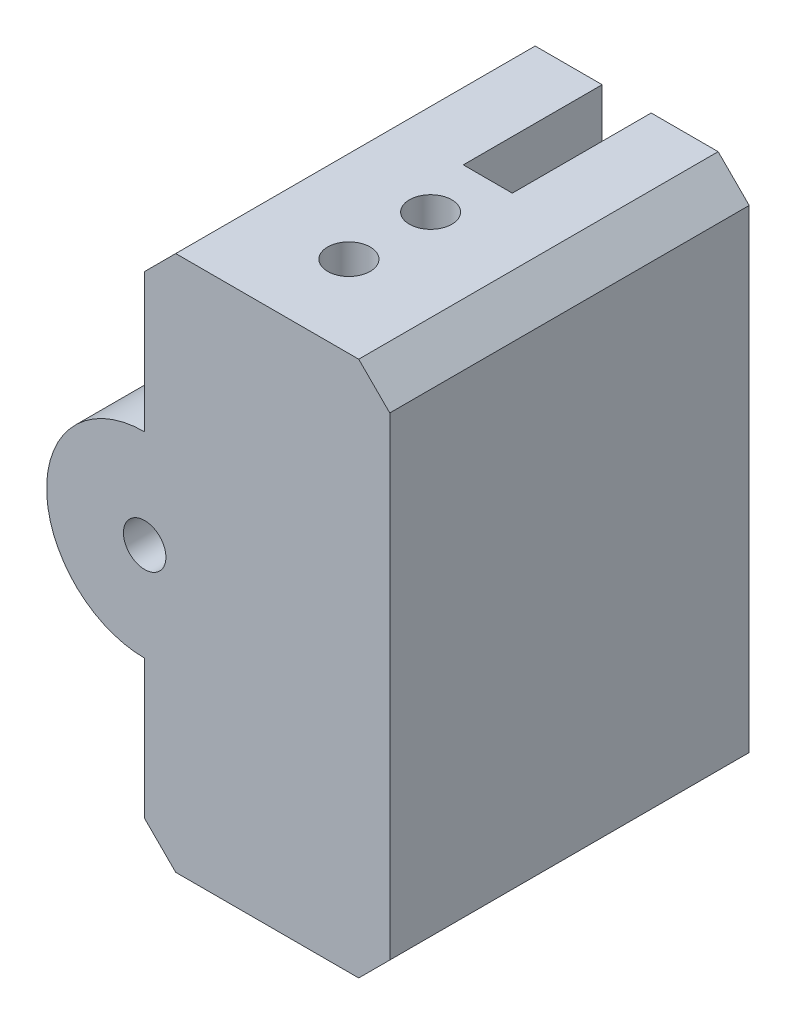
ISO-10303-21;
HEADER;
FILE_DESCRIPTION(('STEP AP214'),'2;1');
FILE_NAME('part.step','',(''),(''),'','','');
FILE_SCHEMA(('AUTOMOTIVE_DESIGN { 1 0 10303 214 1 1 1 1 }'));
ENDSEC;
DATA;
#1=APPLICATION_CONTEXT('core data for automotive mechanical design processes');
#2=APPLICATION_PROTOCOL_DEFINITION('international standard','automotive_design',2000,#1);
#3=PRODUCT_CONTEXT('',#1,'mechanical');
#4=PRODUCT('Part','Part','',(#3));
#5=PRODUCT_RELATED_PRODUCT_CATEGORY('part','',(#4));
#6=PRODUCT_DEFINITION_FORMATION('','',#4);
#7=PRODUCT_DEFINITION_CONTEXT('part definition',#1,'design');
#8=PRODUCT_DEFINITION('design','',#6,#7);
#9=PRODUCT_DEFINITION_SHAPE('','',#8);
#10=(LENGTH_UNIT() NAMED_UNIT(*) SI_UNIT(.MILLI.,.METRE.));
#11=(NAMED_UNIT(*) PLANE_ANGLE_UNIT() SI_UNIT($,.RADIAN.));
#12=(NAMED_UNIT(*) SI_UNIT($,.STERADIAN.) SOLID_ANGLE_UNIT());
#13=UNCERTAINTY_MEASURE_WITH_UNIT(LENGTH_MEASURE(1.E-05),#10,'distance_accuracy_value','');
#14=(GEOMETRIC_REPRESENTATION_CONTEXT(3) GLOBAL_UNCERTAINTY_ASSIGNED_CONTEXT((#13)) GLOBAL_UNIT_ASSIGNED_CONTEXT((#10,
#11,#12)) REPRESENTATION_CONTEXT('',''));
#15=CARTESIAN_POINT('',(0.,0.,0.));
#16=DIRECTION('',(0.,0.,1.));
#17=DIRECTION('',(1.,0.,0.));
#18=AXIS2_PLACEMENT_3D('',#15,#16,#17);
#19=CARTESIAN_POINT('',(-7.5,32.8,0.));
#20=DIRECTION('',(1.,0.,0.));
#21=DIRECTION('',(0.,0.,-1.));
#22=AXIS2_PLACEMENT_3D('',#19,#20,#21);
#23=PLANE('',#22);
#24=DIRECTION('',(0.,-1.,0.));
#25=VECTOR('',#24,1.);
#26=CARTESIAN_POINT('',(-7.5,32.8,22.));
#27=LINE('',#26,#25);
#28=CARTESIAN_POINT('',(-7.5,10.4,22.));
#29=VERTEX_POINT('',#28);
#30=CARTESIAN_POINT('',(-7.5,1.9,22.));
#31=VERTEX_POINT('',#30);
#32=EDGE_CURVE('E66',#29,#31,#27,.T.);
#33=ORIENTED_EDGE('',*,*,#32,.F.);
#34=DIRECTION('',(0.,0.,-1.));
#35=VECTOR('',#34,1.);
#36=CARTESIAN_POINT('',(-7.5,10.4,22.));
#37=LINE('',#36,#35);
#38=CARTESIAN_POINT('',(-7.5,10.4,0.));
#39=VERTEX_POINT('',#38);
#40=EDGE_CURVE('E154',#29,#39,#37,.T.);
#41=ORIENTED_EDGE('',*,*,#40,.T.);
#42=DIRECTION('',(0.,-1.,0.));
#43=VECTOR('',#42,1.);
#44=CARTESIAN_POINT('',(-7.5,32.8,0.));
#45=LINE('',#44,#43);
#46=CARTESIAN_POINT('',(-7.5,1.9,0.));
#47=VERTEX_POINT('',#46);
#48=EDGE_CURVE('E145',#39,#47,#45,.T.);
#49=ORIENTED_EDGE('',*,*,#48,.T.);
#50=DIRECTION('',(0.,0.,1.));
#51=VECTOR('',#50,1.);
#52=CARTESIAN_POINT('',(-7.5,1.9,0.));
#53=LINE('',#52,#51);
#54=EDGE_CURVE('E248',#47,#31,#53,.T.);
#55=ORIENTED_EDGE('',*,*,#54,.T.);
#56=EDGE_LOOP('',(#33,#41,#49,#55));
#57=FACE_BOUND('',#56,.T.);
#58=ADVANCED_FACE('F43',(#57),#23,.F.);
#59=CARTESIAN_POINT('',(1.5,32.8,0.));
#60=DIRECTION('',(-1.,0.,0.));
#61=DIRECTION('',(0.,0.,1.));
#62=AXIS2_PLACEMENT_3D('',#59,#60,#61);
#63=PLANE('',#62);
#64=DIRECTION('',(0.,0.,-1.));
#65=VECTOR('',#64,1.);
#66=CARTESIAN_POINT('',(1.5,0.,0.));
#67=LINE('',#66,#65);
#68=CARTESIAN_POINT('',(1.5,0.,8.5));
#69=VERTEX_POINT('',#68);
#70=CARTESIAN_POINT('',(1.5,0.,0.));
#71=VERTEX_POINT('',#70);
#72=EDGE_CURVE('E197',#69,#71,#67,.T.);
#73=ORIENTED_EDGE('',*,*,#72,.F.);
#74=DIRECTION('',(0.,-1.,0.));
#75=VECTOR('',#74,1.);
#76=CARTESIAN_POINT('',(1.5,32.8,8.5));
#77=LINE('',#76,#75);
#78=CARTESIAN_POINT('',(1.5,32.8,8.5));
#79=VERTEX_POINT('',#78);
#80=EDGE_CURVE('E225',#79,#69,#77,.T.);
#81=ORIENTED_EDGE('',*,*,#80,.F.);
#82=DIRECTION('',(0.,0.,-1.));
#83=VECTOR('',#82,1.);
#84=CARTESIAN_POINT('',(1.5,32.8,0.));
#85=LINE('',#84,#83);
#86=CARTESIAN_POINT('',(1.5,32.8,0.));
#87=VERTEX_POINT('',#86);
#88=EDGE_CURVE('E178',#79,#87,#85,.T.);
#89=ORIENTED_EDGE('',*,*,#88,.T.);
#90=DIRECTION('',(0.,-1.,0.));
#91=VECTOR('',#90,1.);
#92=CARTESIAN_POINT('',(1.5,32.8,0.));
#93=LINE('',#92,#91);
#94=EDGE_CURVE('E211',#87,#71,#93,.T.);
#95=ORIENTED_EDGE('',*,*,#94,.T.);
#96=EDGE_LOOP('',(#73,#81,#89,#95));
#97=FACE_BOUND('',#96,.T.);
#98=ADVANCED_FACE('F289',(#97),#63,.T.);
#99=CARTESIAN_POINT('',(0.,32.8,8.5));
#100=DIRECTION('',(0.,0.,-1.));
#101=DIRECTION('',(-1.,0.,0.));
#102=AXIS2_PLACEMENT_3D('',#99,#100,#101);
#103=PLANE('',#102);
#104=DIRECTION('',(1.,0.,0.));
#105=VECTOR('',#104,1.);
#106=CARTESIAN_POINT('',(0.,0.,8.5));
#107=LINE('',#106,#105);
#108=CARTESIAN_POINT('',(-1.5,0.,8.5));
#109=VERTEX_POINT('',#108);
#110=EDGE_CURVE('E200',#109,#69,#107,.T.);
#111=ORIENTED_EDGE('',*,*,#110,.F.);
#112=DIRECTION('',(0.,-1.,0.));
#113=VECTOR('',#112,1.);
#114=CARTESIAN_POINT('',(-1.5,32.8,8.5));
#115=LINE('',#114,#113);
#116=CARTESIAN_POINT('',(-1.5,32.8,8.5));
#117=VERTEX_POINT('',#116);
#118=EDGE_CURVE('E223',#117,#109,#115,.T.);
#119=ORIENTED_EDGE('',*,*,#118,.F.);
#120=DIRECTION('',(1.,0.,0.));
#121=VECTOR('',#120,1.);
#122=CARTESIAN_POINT('',(0.,32.8,8.5));
#123=LINE('',#122,#121);
#124=EDGE_CURVE('E181',#117,#79,#123,.T.);
#125=ORIENTED_EDGE('',*,*,#124,.T.);
#126=ORIENTED_EDGE('',*,*,#80,.T.);
#127=EDGE_LOOP('',(#111,#119,#125,#126));
#128=FACE_BOUND('',#127,.T.);
#129=ADVANCED_FACE('F293',(#128),#103,.T.);
#130=CARTESIAN_POINT('',(-1.5,32.8,0.));
#131=DIRECTION('',(-1.,0.,0.));
#132=DIRECTION('',(0.,0.,1.));
#133=AXIS2_PLACEMENT_3D('',#130,#131,#132);
#134=PLANE('',#133);
#135=ORIENTED_EDGE('',*,*,#118,.T.);
#136=DIRECTION('',(0.,0.,-1.));
#137=VECTOR('',#136,1.);
#138=CARTESIAN_POINT('',(-1.5,0.,0.));
#139=LINE('',#138,#137);
#140=CARTESIAN_POINT('',(-1.5,0.,0.));
#141=VERTEX_POINT('',#140);
#142=EDGE_CURVE('E203',#109,#141,#139,.T.);
#143=ORIENTED_EDGE('',*,*,#142,.T.);
#144=DIRECTION('',(0.,-1.,0.));
#145=VECTOR('',#144,1.);
#146=CARTESIAN_POINT('',(-1.5,32.8,0.));
#147=LINE('',#146,#145);
#148=CARTESIAN_POINT('',(-1.5,32.8,0.));
#149=VERTEX_POINT('',#148);
#150=EDGE_CURVE('E221',#149,#141,#147,.T.);
#151=ORIENTED_EDGE('',*,*,#150,.F.);
#152=DIRECTION('',(0.,0.,-1.));
#153=VECTOR('',#152,1.);
#154=CARTESIAN_POINT('',(-1.5,32.8,0.));
#155=LINE('',#154,#153);
#156=EDGE_CURVE('E184',#117,#149,#155,.T.);
#157=ORIENTED_EDGE('',*,*,#156,.F.);
#158=EDGE_LOOP('',(#135,#143,#151,#157));
#159=FACE_BOUND('',#158,.T.);
#160=ADVANCED_FACE('F283',(#159),#134,.F.);
#161=CARTESIAN_POINT('',(0.,32.8,0.));
#162=DIRECTION('',(0.,0.,-1.));
#163=DIRECTION('',(-1.,0.,0.));
#164=AXIS2_PLACEMENT_3D('',#161,#162,#163);
#165=PLANE('',#164);
#166=CARTESIAN_POINT('',(-7.5,16.4,0.));
#167=DIRECTION('',(0.,0.,-1.));
#168=DIRECTION('',(-1.,0.,0.));
#169=AXIS2_PLACEMENT_3D('',#166,#167,#168);
#170=CIRCLE('',#169,1.3);
#171=CARTESIAN_POINT('',(-8.8,16.4,0.));
#172=VERTEX_POINT('',#171);
#173=EDGE_CURVE('E163',#172,#172,#170,.T.);
#174=ORIENTED_EDGE('',*,*,#173,.F.);
#175=EDGE_LOOP('',(#174));
#176=FACE_BOUND('',#175,.T.);
#177=ORIENTED_EDGE('',*,*,#48,.F.);
#178=CARTESIAN_POINT('',(-7.5,16.4,0.));
#179=DIRECTION('',(0.,0.,-1.));
#180=DIRECTION('',(-1.,0.,0.));
#181=AXIS2_PLACEMENT_3D('',#178,#179,#180);
#182=CIRCLE('',#181,6.);
#183=CARTESIAN_POINT('',(-7.5,22.4,0.));
#184=VERTEX_POINT('',#183);
#185=EDGE_CURVE('E148',#39,#184,#182,.T.);
#186=ORIENTED_EDGE('',*,*,#185,.T.);
#187=CARTESIAN_POINT('',(-7.5,30.9,0.));
#188=VERTEX_POINT('',#187);
#189=EDGE_CURVE('E58',#188,#184,#45,.T.);
#190=ORIENTED_EDGE('',*,*,#189,.F.);
#191=DIRECTION('',(0.707106781186546,0.707106781186549,0.));
#192=VECTOR('',#191,1.);
#193=CARTESIAN_POINT('',(-2.80000000000001,35.6,0.));
#194=LINE('',#193,#192);
#195=CARTESIAN_POINT('',(-5.6,32.8,0.));
#196=VERTEX_POINT('',#195);
#197=EDGE_CURVE('E256',#188,#196,#194,.T.);
#198=ORIENTED_EDGE('',*,*,#197,.T.);
#199=DIRECTION('',(1.,0.,0.));
#200=VECTOR('',#199,1.);
#201=CARTESIAN_POINT('',(0.,32.8,0.));
#202=LINE('',#201,#200);
#203=EDGE_CURVE('E187',#196,#149,#202,.T.);
#204=ORIENTED_EDGE('',*,*,#203,.T.);
#205=ORIENTED_EDGE('',*,*,#150,.T.);
#206=DIRECTION('',(1.,0.,0.));
#207=VECTOR('',#206,1.);
#208=CARTESIAN_POINT('',(0.,0.,0.));
#209=LINE('',#208,#207);
#210=CARTESIAN_POINT('',(-5.59999999999999,0.,0.));
#211=VERTEX_POINT('',#210);
#212=EDGE_CURVE('E206',#211,#141,#209,.T.);
#213=ORIENTED_EDGE('',*,*,#212,.F.);
#214=DIRECTION('',(0.70710678118655,-0.707106781186546,0.));
#215=VECTOR('',#214,1.);
#216=CARTESIAN_POINT('',(-19.2,13.5999999999999,0.));
#217=LINE('',#216,#215);
#218=EDGE_CURVE('E51',#211,#47,#217,.F.);
#219=ORIENTED_EDGE('',*,*,#218,.T.);
#220=EDGE_LOOP('',(#177,#186,#190,#198,#204,#205,#213,#219));
#221=FACE_BOUND('',#220,.T.);
#222=ADVANCED_FACE('F146',(#176,#221),#165,.T.);
#223=ORIENTED_EDGE('',*,*,#189,.T.);
#224=DIRECTION('',(0.,0.,-1.));
#225=VECTOR('',#224,1.);
#226=CARTESIAN_POINT('',(-7.5,22.4,22.));
#227=LINE('',#226,#225);
#228=CARTESIAN_POINT('',(-7.5,22.4,22.));
#229=VERTEX_POINT('',#228);
#230=EDGE_CURVE('E159',#184,#229,#227,.F.);
#231=ORIENTED_EDGE('',*,*,#230,.T.);
#232=CARTESIAN_POINT('',(-7.5,30.9,22.));
#233=VERTEX_POINT('',#232);
#234=EDGE_CURVE('E152',#233,#229,#27,.T.);
#235=ORIENTED_EDGE('',*,*,#234,.F.);
#236=DIRECTION('',(0.,0.,-1.));
#237=VECTOR('',#236,1.);
#238=CARTESIAN_POINT('',(-7.5,30.9,0.));
#239=LINE('',#238,#237);
#240=EDGE_CURVE('E246',#233,#188,#239,.T.);
#241=ORIENTED_EDGE('',*,*,#240,.T.);
#242=EDGE_LOOP('',(#223,#231,#235,#241));
#243=FACE_BOUND('',#242,.T.);
#244=ADVANCED_FACE('F271',(#243),#23,.F.);
#245=CARTESIAN_POINT('',(0.,32.8,22.));
#246=DIRECTION('',(0.,0.,-1.));
#247=DIRECTION('',(-1.,0.,0.));
#248=AXIS2_PLACEMENT_3D('',#245,#246,#247);
#249=PLANE('',#248);
#250=CARTESIAN_POINT('',(-7.5,16.4,22.));
#251=DIRECTION('',(0.,0.,-1.));
#252=DIRECTION('',(-1.,0.,0.));
#253=AXIS2_PLACEMENT_3D('',#250,#251,#252);
#254=CIRCLE('',#253,1.3);
#255=CARTESIAN_POINT('',(-8.8,16.4,22.));
#256=VERTEX_POINT('',#255);
#257=EDGE_CURVE('E167',#256,#256,#254,.T.);
#258=ORIENTED_EDGE('',*,*,#257,.T.);
#259=EDGE_LOOP('',(#258));
#260=FACE_BOUND('',#259,.T.);
#261=ORIENTED_EDGE('',*,*,#234,.T.);
#262=CARTESIAN_POINT('',(-7.5,16.4,22.));
#263=DIRECTION('',(0.,0.,-1.));
#264=DIRECTION('',(-1.,0.,0.));
#265=AXIS2_PLACEMENT_3D('',#262,#263,#264);
#266=CIRCLE('',#265,6.);
#267=EDGE_CURVE('E162',#29,#229,#266,.T.);
#268=ORIENTED_EDGE('',*,*,#267,.F.);
#269=ORIENTED_EDGE('',*,*,#32,.T.);
#270=DIRECTION('',(-0.70710678118655,0.707106781186546,0.));
#271=VECTOR('',#270,1.);
#272=CARTESIAN_POINT('',(-7.5,1.9,22.));
#273=LINE('',#272,#271);
#274=CARTESIAN_POINT('',(-5.59999999999999,0.,22.));
#275=VERTEX_POINT('',#274);
#276=EDGE_CURVE('E252',#31,#275,#273,.F.);
#277=ORIENTED_EDGE('',*,*,#276,.T.);
#278=DIRECTION('',(1.,0.,0.));
#279=VECTOR('',#278,1.);
#280=CARTESIAN_POINT('',(0.,0.,22.));
#281=LINE('',#280,#279);
#282=CARTESIAN_POINT('',(5.6,0.,22.));
#283=VERTEX_POINT('',#282);
#284=EDGE_CURVE('E209',#275,#283,#281,.T.);
#285=ORIENTED_EDGE('',*,*,#284,.T.);
#286=DIRECTION('',(0.707106781186546,0.707106781186549,0.));
#287=VECTOR('',#286,1.);
#288=CARTESIAN_POINT('',(5.6,0.,22.));
#289=LINE('',#288,#287);
#290=CARTESIAN_POINT('',(7.50000000000001,1.90000000000001,22.));
#291=VERTEX_POINT('',#290);
#292=EDGE_CURVE('E232',#283,#291,#289,.T.);
#293=ORIENTED_EDGE('',*,*,#292,.T.);
#294=DIRECTION('',(0.,-1.,0.));
#295=VECTOR('',#294,1.);
#296=CARTESIAN_POINT('',(7.50000000000001,32.8,22.));
#297=LINE('',#296,#295);
#298=CARTESIAN_POINT('',(7.50000000000001,30.9,22.));
#299=VERTEX_POINT('',#298);
#300=EDGE_CURVE('E216',#299,#291,#297,.T.);
#301=ORIENTED_EDGE('',*,*,#300,.F.);
#302=DIRECTION('',(0.707106781186548,-0.707106781186547,0.));
#303=VECTOR('',#302,1.);
#304=CARTESIAN_POINT('',(7.50000000000001,30.9,22.));
#305=LINE('',#304,#303);
#306=CARTESIAN_POINT('',(5.60000000000001,32.8,22.));
#307=VERTEX_POINT('',#306);
#308=EDGE_CURVE('E234',#299,#307,#305,.F.);
#309=ORIENTED_EDGE('',*,*,#308,.T.);
#310=DIRECTION('',(1.,0.,0.));
#311=VECTOR('',#310,1.);
#312=CARTESIAN_POINT('',(0.,32.8,22.));
#313=LINE('',#312,#311);
#314=CARTESIAN_POINT('',(-5.6,32.8,22.));
#315=VERTEX_POINT('',#314);
#316=EDGE_CURVE('E189',#315,#307,#313,.T.);
#317=ORIENTED_EDGE('',*,*,#316,.F.);
#318=DIRECTION('',(-0.707106781186546,-0.707106781186549,0.));
#319=VECTOR('',#318,1.);
#320=CARTESIAN_POINT('',(-5.6,32.8,22.));
#321=LINE('',#320,#319);
#322=EDGE_CURVE('E250',#315,#233,#321,.T.);
#323=ORIENTED_EDGE('',*,*,#322,.T.);
#324=EDGE_LOOP('',(#261,#268,#269,#277,#285,#293,#301,#309,#317,#323));
#325=FACE_BOUND('',#324,.T.);
#326=ADVANCED_FACE('F270',(#260,#325),#249,.F.);
#327=CARTESIAN_POINT('',(7.5,32.8,0.));
#328=DIRECTION('',(1.,0.,0.));
#329=DIRECTION('',(0.,0.,-1.));
#330=AXIS2_PLACEMENT_3D('',#327,#328,#329);
#331=PLANE('',#330);
#332=DIRECTION('',(0.,-1.,0.));
#333=VECTOR('',#332,1.);
#334=CARTESIAN_POINT('',(7.5,32.8,0.));
#335=LINE('',#334,#333);
#336=CARTESIAN_POINT('',(7.5,30.9,0.));
#337=VERTEX_POINT('',#336);
#338=CARTESIAN_POINT('',(7.5,1.90000000000001,0.));
#339=VERTEX_POINT('',#338);
#340=EDGE_CURVE('E213',#337,#339,#335,.T.);
#341=ORIENTED_EDGE('',*,*,#340,.F.);
#342=DIRECTION('',(0.,0.,1.));
#343=VECTOR('',#342,1.);
#344=CARTESIAN_POINT('',(7.5,30.9,0.));
#345=LINE('',#344,#343);
#346=EDGE_CURVE('E229',#337,#299,#345,.T.);
#347=ORIENTED_EDGE('',*,*,#346,.T.);
#348=ORIENTED_EDGE('',*,*,#300,.T.);
#349=DIRECTION('',(0.,0.,-1.));
#350=VECTOR('',#349,1.);
#351=CARTESIAN_POINT('',(7.5,1.90000000000001,0.));
#352=LINE('',#351,#350);
#353=EDGE_CURVE('E227',#291,#339,#352,.T.);
#354=ORIENTED_EDGE('',*,*,#353,.T.);
#355=EDGE_LOOP('',(#341,#347,#348,#354));
#356=FACE_BOUND('',#355,.T.);
#357=ADVANCED_FACE('F279',(#356),#331,.T.);
#358=CARTESIAN_POINT('',(0.,32.8,17.));
#359=DIRECTION('',(0.,-1.,0.));
#360=DIRECTION('',(0.,0.,-1.));
#361=AXIS2_PLACEMENT_3D('',#358,#359,#360);
#362=CYLINDRICAL_SURFACE('',#361,1.3);
#363=CARTESIAN_POINT('',(0.,32.8,17.));
#364=DIRECTION('',(0.,1.,0.));
#365=DIRECTION('',(0.,0.,1.));
#366=AXIS2_PLACEMENT_3D('',#363,#364,#365);
#367=CIRCLE('',#366,1.3);
#368=CARTESIAN_POINT('',(0.,32.8,18.3));
#369=VERTEX_POINT('',#368);
#370=EDGE_CURVE('E174',#369,#369,#367,.T.);
#371=ORIENTED_EDGE('',*,*,#370,.T.);
#372=EDGE_LOOP('',(#371));
#373=FACE_BOUND('',#372,.T.);
#374=CARTESIAN_POINT('',(0.,0.,17.));
#375=DIRECTION('',(0.,1.,0.));
#376=DIRECTION('',(0.,0.,1.));
#377=AXIS2_PLACEMENT_3D('',#374,#375,#376);
#378=CIRCLE('',#377,1.3);
#379=CARTESIAN_POINT('',(0.,0.,18.3));
#380=VERTEX_POINT('',#379);
#381=EDGE_CURVE('E194',#380,#380,#378,.T.);
#382=ORIENTED_EDGE('',*,*,#381,.F.);
#383=EDGE_LOOP('',(#382));
#384=FACE_BOUND('',#383,.T.);
#385=ADVANCED_FACE('F304',(#373,#384),#362,.F.);
#386=CARTESIAN_POINT('',(0.,32.8,12.));
#387=DIRECTION('',(0.,-1.,0.));
#388=DIRECTION('',(0.,0.,-1.));
#389=AXIS2_PLACEMENT_3D('',#386,#387,#388);
#390=CYLINDRICAL_SURFACE('',#389,1.3);
#391=CARTESIAN_POINT('',(0.,32.8,12.));
#392=DIRECTION('',(0.,1.,0.));
#393=DIRECTION('',(0.,0.,1.));
#394=AXIS2_PLACEMENT_3D('',#391,#392,#393);
#395=CIRCLE('',#394,1.3);
#396=CARTESIAN_POINT('',(0.,32.8,13.3));
#397=VERTEX_POINT('',#396);
#398=EDGE_CURVE('E171',#397,#397,#395,.T.);
#399=ORIENTED_EDGE('',*,*,#398,.T.);
#400=EDGE_LOOP('',(#399));
#401=FACE_BOUND('',#400,.T.);
#402=CARTESIAN_POINT('',(0.,0.,12.));
#403=DIRECTION('',(0.,1.,0.));
#404=DIRECTION('',(0.,0.,1.));
#405=AXIS2_PLACEMENT_3D('',#402,#403,#404);
#406=CIRCLE('',#405,1.3);
#407=CARTESIAN_POINT('',(0.,0.,13.3));
#408=VERTEX_POINT('',#407);
#409=EDGE_CURVE('E158',#408,#408,#406,.T.);
#410=ORIENTED_EDGE('',*,*,#409,.F.);
#411=EDGE_LOOP('',(#410));
#412=FACE_BOUND('',#411,.T.);
#413=ADVANCED_FACE('F306',(#401,#412),#390,.F.);
#414=CARTESIAN_POINT('',(5.60000000000001,32.8,0.));
#415=VERTEX_POINT('',#414);
#416=EDGE_CURVE('E190',#87,#415,#202,.T.);
#417=ORIENTED_EDGE('',*,*,#416,.T.);
#418=DIRECTION('',(-0.707106781186548,0.707106781186547,0.));
#419=VECTOR('',#418,1.);
#420=CARTESIAN_POINT('',(2.8,35.6,0.));
#421=LINE('',#420,#419);
#422=EDGE_CURVE('E241',#415,#337,#421,.F.);
#423=ORIENTED_EDGE('',*,*,#422,.T.);
#424=ORIENTED_EDGE('',*,*,#340,.T.);
#425=DIRECTION('',(-0.707106781186546,-0.707106781186549,0.));
#426=VECTOR('',#425,1.);
#427=CARTESIAN_POINT('',(19.2,13.6000000000001,0.));
#428=LINE('',#427,#426);
#429=CARTESIAN_POINT('',(5.6,0.,0.));
#430=VERTEX_POINT('',#429);
#431=EDGE_CURVE('E239',#339,#430,#428,.T.);
#432=ORIENTED_EDGE('',*,*,#431,.T.);
#433=EDGE_CURVE('E175',#71,#430,#209,.T.);
#434=ORIENTED_EDGE('',*,*,#433,.F.);
#435=ORIENTED_EDGE('',*,*,#94,.F.);
#436=EDGE_LOOP('',(#417,#423,#424,#432,#434,#435));
#437=FACE_BOUND('',#436,.T.);
#438=ADVANCED_FACE('F286',(#437),#165,.T.);
#439=CARTESIAN_POINT('',(0.,32.8,0.));
#440=DIRECTION('',(0.,1.,0.));
#441=DIRECTION('',(0.,0.,1.));
#442=AXIS2_PLACEMENT_3D('',#439,#440,#441);
#443=PLANE('',#442);
#444=ORIENTED_EDGE('',*,*,#398,.F.);
#445=EDGE_LOOP('',(#444));
#446=FACE_BOUND('',#445,.T.);
#447=ORIENTED_EDGE('',*,*,#370,.F.);
#448=EDGE_LOOP('',(#447));
#449=FACE_BOUND('',#448,.T.);
#450=ORIENTED_EDGE('',*,*,#203,.F.);
#451=DIRECTION('',(0.,0.,1.));
#452=VECTOR('',#451,1.);
#453=CARTESIAN_POINT('',(-5.6,32.8,22.));
#454=LINE('',#453,#452);
#455=EDGE_CURVE('E11',#196,#315,#454,.T.);
#456=ORIENTED_EDGE('',*,*,#455,.T.);
#457=ORIENTED_EDGE('',*,*,#316,.T.);
#458=DIRECTION('',(0.,0.,-1.));
#459=VECTOR('',#458,1.);
#460=CARTESIAN_POINT('',(5.60000000000001,32.8,0.));
#461=LINE('',#460,#459);
#462=EDGE_CURVE('E237',#307,#415,#461,.T.);
#463=ORIENTED_EDGE('',*,*,#462,.T.);
#464=ORIENTED_EDGE('',*,*,#416,.F.);
#465=ORIENTED_EDGE('',*,*,#88,.F.);
#466=ORIENTED_EDGE('',*,*,#124,.F.);
#467=ORIENTED_EDGE('',*,*,#156,.T.);
#468=EDGE_LOOP('',(#450,#456,#457,#463,#464,#465,#466,#467));
#469=FACE_BOUND('',#468,.T.);
#470=ADVANCED_FACE('F263',(#446,#449,#469),#443,.T.);
#471=CARTESIAN_POINT('',(0.,0.,0.));
#472=DIRECTION('',(0.,1.,0.));
#473=DIRECTION('',(0.,0.,1.));
#474=AXIS2_PLACEMENT_3D('',#471,#472,#473);
#475=PLANE('',#474);
#476=ORIENTED_EDGE('',*,*,#409,.T.);
#477=EDGE_LOOP('',(#476));
#478=FACE_BOUND('',#477,.T.);
#479=ORIENTED_EDGE('',*,*,#381,.T.);
#480=EDGE_LOOP('',(#479));
#481=FACE_BOUND('',#480,.T.);
#482=ORIENTED_EDGE('',*,*,#284,.F.);
#483=DIRECTION('',(0.,0.,-1.));
#484=VECTOR('',#483,1.);
#485=CARTESIAN_POINT('',(-5.59999999999999,0.,0.));
#486=LINE('',#485,#484);
#487=EDGE_CURVE('E254',#275,#211,#486,.T.);
#488=ORIENTED_EDGE('',*,*,#487,.T.);
#489=ORIENTED_EDGE('',*,*,#212,.T.);
#490=ORIENTED_EDGE('',*,*,#142,.F.);
#491=ORIENTED_EDGE('',*,*,#110,.T.);
#492=ORIENTED_EDGE('',*,*,#72,.T.);
#493=ORIENTED_EDGE('',*,*,#433,.T.);
#494=DIRECTION('',(0.,0.,1.));
#495=VECTOR('',#494,1.);
#496=CARTESIAN_POINT('',(5.6,0.,22.));
#497=LINE('',#496,#495);
#498=EDGE_CURVE('E243',#430,#283,#497,.T.);
#499=ORIENTED_EDGE('',*,*,#498,.T.);
#500=EDGE_LOOP('',(#482,#488,#489,#490,#491,#492,#493,#499));
#501=FACE_BOUND('',#500,.T.);
#502=ADVANCED_FACE('F315',(#478,#481,#501),#475,.F.);
#503=CARTESIAN_POINT('',(7.5,30.9,0.));
#504=DIRECTION('',(-0.707106781186547,-0.707106781186548,0.));
#505=DIRECTION('',(0.,0.,1.));
#506=AXIS2_PLACEMENT_3D('',#503,#504,#505);
#507=PLANE('',#506);
#508=ORIENTED_EDGE('',*,*,#422,.F.);
#509=ORIENTED_EDGE('',*,*,#462,.F.);
#510=ORIENTED_EDGE('',*,*,#308,.F.);
#511=ORIENTED_EDGE('',*,*,#346,.F.);
#512=EDGE_LOOP('',(#508,#509,#510,#511));
#513=FACE_BOUND('',#512,.T.);
#514=ADVANCED_FACE('F311',(#513),#507,.F.);
#515=CARTESIAN_POINT('',(5.6,0.,0.));
#516=DIRECTION('',(0.707106781186549,-0.707106781186546,0.));
#517=DIRECTION('',(0.,0.,-1.));
#518=AXIS2_PLACEMENT_3D('',#515,#516,#517);
#519=PLANE('',#518);
#520=ORIENTED_EDGE('',*,*,#431,.F.);
#521=ORIENTED_EDGE('',*,*,#353,.F.);
#522=ORIENTED_EDGE('',*,*,#292,.F.);
#523=ORIENTED_EDGE('',*,*,#498,.F.);
#524=EDGE_LOOP('',(#520,#521,#522,#523));
#525=FACE_BOUND('',#524,.T.);
#526=ADVANCED_FACE('F314',(#525),#519,.T.);
#527=CARTESIAN_POINT('',(-7.5,1.9,0.));
#528=DIRECTION('',(0.707106781186546,0.70710678118655,0.));
#529=DIRECTION('',(0.,0.,1.));
#530=AXIS2_PLACEMENT_3D('',#527,#528,#529);
#531=PLANE('',#530);
#532=ORIENTED_EDGE('',*,*,#218,.F.);
#533=ORIENTED_EDGE('',*,*,#487,.F.);
#534=ORIENTED_EDGE('',*,*,#276,.F.);
#535=ORIENTED_EDGE('',*,*,#54,.F.);
#536=EDGE_LOOP('',(#532,#533,#534,#535));
#537=FACE_BOUND('',#536,.T.);
#538=ADVANCED_FACE('F318',(#537),#531,.F.);
#539=CARTESIAN_POINT('',(-5.6,32.8,0.));
#540=DIRECTION('',(-0.707106781186549,0.707106781186546,0.));
#541=DIRECTION('',(0.,0.,-1.));
#542=AXIS2_PLACEMENT_3D('',#539,#540,#541);
#543=PLANE('',#542);
#544=ORIENTED_EDGE('',*,*,#197,.F.);
#545=ORIENTED_EDGE('',*,*,#240,.F.);
#546=ORIENTED_EDGE('',*,*,#322,.F.);
#547=ORIENTED_EDGE('',*,*,#455,.F.);
#548=EDGE_LOOP('',(#544,#545,#546,#547));
#549=FACE_BOUND('',#548,.T.);
#550=ADVANCED_FACE('F45',(#549),#543,.T.);
#551=CARTESIAN_POINT('',(-7.5,16.4,22.));
#552=DIRECTION('',(0.,0.,-1.));
#553=DIRECTION('',(-1.,0.,0.));
#554=AXIS2_PLACEMENT_3D('',#551,#552,#553);
#555=CYLINDRICAL_SURFACE('',#554,6.);
#556=ORIENTED_EDGE('',*,*,#40,.F.);
#557=ORIENTED_EDGE('',*,*,#267,.T.);
#558=ORIENTED_EDGE('',*,*,#230,.F.);
#559=ORIENTED_EDGE('',*,*,#185,.F.);
#560=EDGE_LOOP('',(#556,#557,#558,#559));
#561=FACE_BOUND('',#560,.T.);
#562=ADVANCED_FACE('F161',(#561),#555,.T.);
#563=CARTESIAN_POINT('',(-7.5,16.4,22.));
#564=DIRECTION('',(0.,0.,-1.));
#565=DIRECTION('',(-1.,0.,0.));
#566=AXIS2_PLACEMENT_3D('',#563,#564,#565);
#567=CYLINDRICAL_SURFACE('',#566,1.3);
#568=ORIENTED_EDGE('',*,*,#173,.T.);
#569=EDGE_LOOP('',(#568));
#570=FACE_BOUND('',#569,.T.);
#571=ORIENTED_EDGE('',*,*,#257,.F.);
#572=EDGE_LOOP('',(#571));
#573=FACE_BOUND('',#572,.T.);
#574=ADVANCED_FACE('F434',(#570,#573),#567,.F.);
#575=CLOSED_SHELL('',(#58,#98,#129,#160,#222,#244,#326,#357,#385,#413,#438,#470,#502,#514,#526,
#538,#550,#562,#574));
#576=MANIFOLD_SOLID_BREP('B2',#575);
#577=ADVANCED_BREP_SHAPE_REPRESENTATION('',(#18,#576),#14);
#578=SHAPE_DEFINITION_REPRESENTATION(#9,#577);
ENDSEC;
END-ISO-10303-21;
